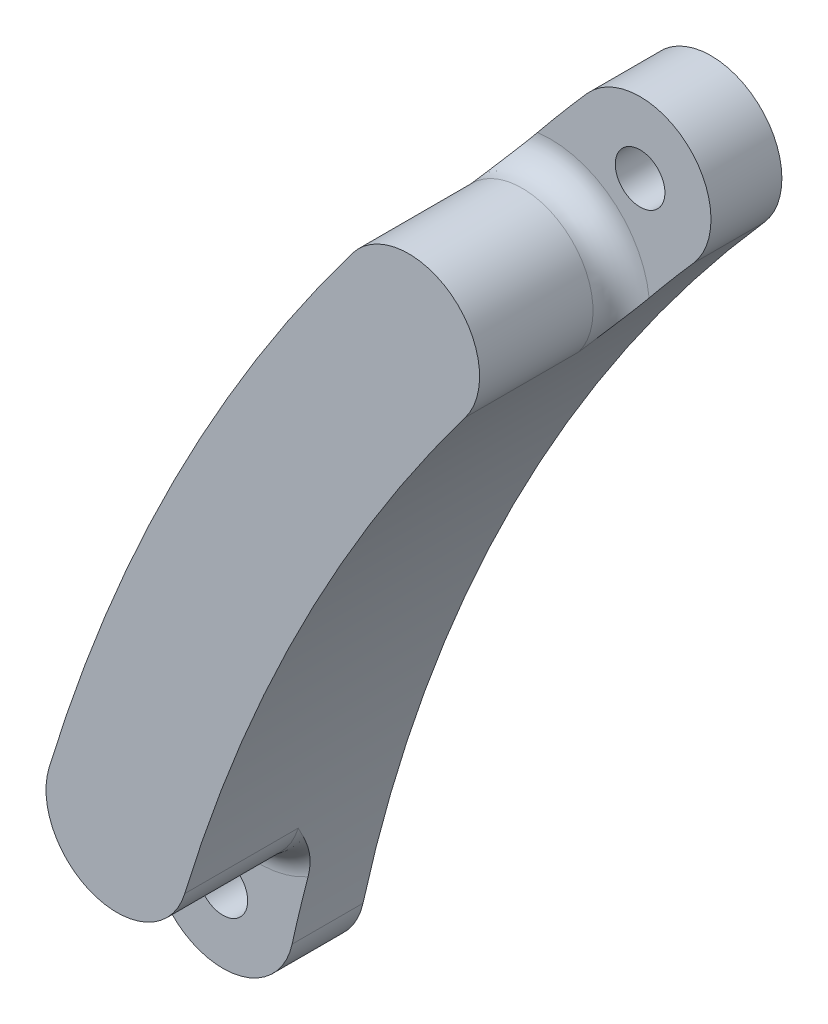
ISO-10303-21;
HEADER;
FILE_DESCRIPTION(('STEP AP214'),'2;1');
FILE_NAME('part.step','',(''),(''),'','','');
FILE_SCHEMA(('AUTOMOTIVE_DESIGN { 1 0 10303 214 1 1 1 1 }'));
ENDSEC;
DATA;
#1=APPLICATION_CONTEXT('core data for automotive mechanical design processes');
#2=APPLICATION_PROTOCOL_DEFINITION('international standard','automotive_design',2000,#1);
#3=PRODUCT_CONTEXT('',#1,'mechanical');
#4=PRODUCT('Part','Part','',(#3));
#5=PRODUCT_RELATED_PRODUCT_CATEGORY('part','',(#4));
#6=PRODUCT_DEFINITION_FORMATION('','',#4);
#7=PRODUCT_DEFINITION_CONTEXT('part definition',#1,'design');
#8=PRODUCT_DEFINITION('design','',#6,#7);
#9=PRODUCT_DEFINITION_SHAPE('','',#8);
#10=(LENGTH_UNIT() NAMED_UNIT(*) SI_UNIT(.MILLI.,.METRE.));
#11=(NAMED_UNIT(*) PLANE_ANGLE_UNIT() SI_UNIT($,.RADIAN.));
#12=(NAMED_UNIT(*) SI_UNIT($,.STERADIAN.) SOLID_ANGLE_UNIT());
#13=UNCERTAINTY_MEASURE_WITH_UNIT(LENGTH_MEASURE(1.E-05),#10,'distance_accuracy_value','');
#14=(GEOMETRIC_REPRESENTATION_CONTEXT(3) GLOBAL_UNCERTAINTY_ASSIGNED_CONTEXT((#13)) GLOBAL_UNIT_ASSIGNED_CONTEXT((#10,
#11,#12)) REPRESENTATION_CONTEXT('',''));
#15=CARTESIAN_POINT('',(0.,0.,0.));
#16=DIRECTION('',(0.,0.,1.));
#17=DIRECTION('',(1.,0.,0.));
#18=AXIS2_PLACEMENT_3D('',#15,#16,#17);
#19=CARTESIAN_POINT('',(78.1862958214698,14.9800916458352,5.));
#20=DIRECTION('',(0.,0.,1.));
#21=DIRECTION('',(1.,0.,0.));
#22=AXIS2_PLACEMENT_3D('',#19,#20,#21);
#23=PLANE('',#22);
#24=CARTESIAN_POINT('',(126.949051310368,-27.9988994676136,5.));
#25=DIRECTION('',(0.,0.,1.));
#26=DIRECTION('',(1.,0.,0.));
#27=AXIS2_PLACEMENT_3D('',#24,#25,#26);
#28=CIRCLE('',#27,135.);
#29=CARTESIAN_POINT('',(25.6725591411177,61.2651589987802,5.));
#30=VERTEX_POINT('',#29);
#31=CARTESIAN_POINT('',(22.1873706540222,57.1479752023225,5.));
#32=VERTEX_POINT('',#31);
#33=EDGE_CURVE('E178',#30,#32,#28,.T.);
#34=ORIENTED_EDGE('',*,*,#33,.T.);
#35=CARTESIAN_POINT('',(23.1048173236408,50.2083576618232,5.));
#36=DIRECTION('',(0.,0.,1.));
#37=DIRECTION('',(1.,0.,0.));
#38=AXIS2_PLACEMENT_3D('',#35,#36,#37);
#39=CIRCLE('',#38,7.);
#40=CARTESIAN_POINT('',(30.061993761383,50.9814656841103,5.));
#41=VERTEX_POINT('',#40);
#42=EDGE_CURVE('E218',#32,#41,#39,.F.);
#43=ORIENTED_EDGE('',*,*,#42,.T.);
#44=CARTESIAN_POINT('',(126.949051310368,-27.9988994676136,5.));
#45=DIRECTION('',(0.,0.,-1.));
#46=DIRECTION('',(1.,0.,0.));
#47=AXIS2_PLACEMENT_3D('',#44,#45,#46);
#48=CIRCLE('',#47,125.);
#49=CARTESIAN_POINT('',(33.1745215240252,54.653006519788,5.));
#50=VERTEX_POINT('',#49);
#51=EDGE_CURVE('E185',#41,#50,#48,.T.);
#52=ORIENTED_EDGE('',*,*,#51,.T.);
#53=CARTESIAN_POINT('',(29.4235403325714,57.9590827592841,5.));
#54=DIRECTION('',(0.,0.,1.));
#55=DIRECTION('',(1.,0.,0.));
#56=AXIS2_PLACEMENT_3D('',#53,#54,#55);
#57=CIRCLE('',#56,5.);
#58=EDGE_CURVE('E172',#50,#30,#57,.T.);
#59=ORIENTED_EDGE('',*,*,#58,.T.);
#60=EDGE_LOOP('',(#34,#43,#52,#59));
#61=FACE_BOUND('',#60,.T.);
#62=CARTESIAN_POINT('',(29.4235403325714,57.9590827592841,5.));
#63=DIRECTION('',(0.,0.,1.));
#64=DIRECTION('',(1.,0.,0.));
#65=AXIS2_PLACEMENT_3D('',#62,#63,#64);
#66=CIRCLE('',#65,1.75);
#67=CARTESIAN_POINT('',(31.1735403325714,57.9590827592841,5.));
#68=VERTEX_POINT('',#67);
#69=EDGE_CURVE('E154',#68,#68,#66,.T.);
#70=ORIENTED_EDGE('',*,*,#69,.F.);
#71=EDGE_LOOP('',(#70));
#72=FACE_BOUND('',#71,.T.);
#73=ADVANCED_FACE('F39',(#61,#72),#23,.T.);
#74=CARTESIAN_POINT('',(4.88265581962952,-1.07688074875437,5.));
#75=VERTEX_POINT('',#74);
#76=CARTESIAN_POINT('',(6.00963506176895,3.60264475807368,5.));
#77=VERTEX_POINT('',#76);
#78=EDGE_CURVE('E186',#75,#77,#48,.T.);
#79=ORIENTED_EDGE('',*,*,#78,.T.);
#80=CARTESIAN_POINT('',(2.52775679828154,9.67524912179224,5.));
#81=DIRECTION('',(0.,0.,1.));
#82=DIRECTION('',(1.,0.,0.));
#83=AXIS2_PLACEMENT_3D('',#80,#81,#82);
#84=CIRCLE('',#83,6.99999999999999);
#85=CARTESIAN_POINT('',(-3.61585854962601,6.32025426979101,5.));
#86=VERTEX_POINT('',#85);
#87=EDGE_CURVE('E66',#77,#86,#84,.F.);
#88=ORIENTED_EDGE('',*,*,#87,.T.);
#89=CARTESIAN_POINT('',(-4.88265581962952,1.07688074875439,5.));
#90=VERTEX_POINT('',#89);
#91=EDGE_CURVE('E176',#86,#90,#28,.T.);
#92=ORIENTED_EDGE('',*,*,#91,.T.);
#93=CARTESIAN_POINT('',(0.,0.,5.));
#94=DIRECTION('',(0.,0.,1.));
#95=DIRECTION('',(1.,0.,0.));
#96=AXIS2_PLACEMENT_3D('',#93,#94,#95);
#97=CIRCLE('',#96,4.99999999999998);
#98=EDGE_CURVE('E182',#90,#75,#97,.T.);
#99=ORIENTED_EDGE('',*,*,#98,.T.);
#100=EDGE_LOOP('',(#79,#88,#92,#99));
#101=FACE_BOUND('',#100,.T.);
#102=CARTESIAN_POINT('',(0.,0.,5.));
#103=DIRECTION('',(0.,0.,1.));
#104=DIRECTION('',(1.,0.,0.));
#105=AXIS2_PLACEMENT_3D('',#102,#103,#104);
#106=CIRCLE('',#105,1.75);
#107=CARTESIAN_POINT('',(1.75,0.,5.));
#108=VERTEX_POINT('',#107);
#109=EDGE_CURVE('E164',#108,#108,#106,.T.);
#110=ORIENTED_EDGE('',*,*,#109,.F.);
#111=EDGE_LOOP('',(#110));
#112=FACE_BOUND('',#111,.T.);
#113=ADVANCED_FACE('F253',(#101,#112),#23,.T.);
#114=CARTESIAN_POINT('',(78.1862958214698,14.9800916458352,0.));
#115=DIRECTION('',(0.,0.,1.));
#116=DIRECTION('',(1.,0.,0.));
#117=AXIS2_PLACEMENT_3D('',#114,#115,#116);
#118=PLANE('',#117);
#119=CARTESIAN_POINT('',(29.4235403325714,57.9590827592841,0.));
#120=DIRECTION('',(0.,0.,1.));
#121=DIRECTION('',(1.,0.,0.));
#122=AXIS2_PLACEMENT_3D('',#119,#120,#121);
#123=CIRCLE('',#122,5.);
#124=CARTESIAN_POINT('',(33.1745215240252,54.653006519788,0.));
#125=VERTEX_POINT('',#124);
#126=CARTESIAN_POINT('',(25.6725591411177,61.2651589987802,0.));
#127=VERTEX_POINT('',#126);
#128=EDGE_CURVE('E168',#125,#127,#123,.T.);
#129=ORIENTED_EDGE('',*,*,#128,.F.);
#130=CARTESIAN_POINT('',(126.949051310368,-27.9988994676136,0.));
#131=DIRECTION('',(0.,0.,-1.));
#132=DIRECTION('',(1.,0.,0.));
#133=AXIS2_PLACEMENT_3D('',#130,#131,#132);
#134=CIRCLE('',#133,125.);
#135=CARTESIAN_POINT('',(4.88265581962952,-1.07688074875437,0.));
#136=VERTEX_POINT('',#135);
#137=EDGE_CURVE('E177',#136,#125,#134,.T.);
#138=ORIENTED_EDGE('',*,*,#137,.F.);
#139=CARTESIAN_POINT('',(0.,0.,0.));
#140=DIRECTION('',(0.,0.,1.));
#141=DIRECTION('',(1.,0.,0.));
#142=AXIS2_PLACEMENT_3D('',#139,#140,#141);
#143=CIRCLE('',#142,4.99999999999998);
#144=CARTESIAN_POINT('',(-4.88265581962952,1.07688074875439,0.));
#145=VERTEX_POINT('',#144);
#146=EDGE_CURVE('E196',#145,#136,#143,.T.);
#147=ORIENTED_EDGE('',*,*,#146,.F.);
#148=CARTESIAN_POINT('',(126.949051310368,-27.9988994676136,0.));
#149=DIRECTION('',(0.,0.,1.));
#150=DIRECTION('',(1.,0.,0.));
#151=AXIS2_PLACEMENT_3D('',#148,#149,#150);
#152=CIRCLE('',#151,135.);
#153=EDGE_CURVE('E193',#127,#145,#152,.T.);
#154=ORIENTED_EDGE('',*,*,#153,.F.);
#155=EDGE_LOOP('',(#129,#138,#147,#154));
#156=FACE_BOUND('',#155,.T.);
#157=CARTESIAN_POINT('',(0.,0.,0.));
#158=DIRECTION('',(0.,0.,1.));
#159=DIRECTION('',(1.,0.,0.));
#160=AXIS2_PLACEMENT_3D('',#157,#158,#159);
#161=CIRCLE('',#160,1.75);
#162=CARTESIAN_POINT('',(1.75,0.,0.));
#163=VERTEX_POINT('',#162);
#164=EDGE_CURVE('E162',#163,#163,#161,.T.);
#165=ORIENTED_EDGE('',*,*,#164,.T.);
#166=EDGE_LOOP('',(#165));
#167=FACE_BOUND('',#166,.T.);
#168=CARTESIAN_POINT('',(29.4235403325714,57.9590827592841,0.));
#169=DIRECTION('',(0.,0.,1.));
#170=DIRECTION('',(1.,0.,0.));
#171=AXIS2_PLACEMENT_3D('',#168,#169,#170);
#172=CIRCLE('',#171,1.75);
#173=CARTESIAN_POINT('',(31.1735403325714,57.9590827592841,0.));
#174=VERTEX_POINT('',#173);
#175=EDGE_CURVE('E148',#174,#174,#172,.T.);
#176=ORIENTED_EDGE('',*,*,#175,.T.);
#177=EDGE_LOOP('',(#176));
#178=FACE_BOUND('',#177,.T.);
#179=ADVANCED_FACE('F248',(#156,#167,#178),#118,.F.);
#180=CARTESIAN_POINT('',(29.4235403325714,57.9590827592841,5.));
#181=DIRECTION('',(0.,0.,-1.));
#182=DIRECTION('',(-1.,0.,0.));
#183=AXIS2_PLACEMENT_3D('',#180,#181,#182);
#184=CYLINDRICAL_SURFACE('',#183,5.);
#185=ORIENTED_EDGE('',*,*,#128,.T.);
#186=DIRECTION('',(0.,0.,-1.));
#187=VECTOR('',#186,1.);
#188=CARTESIAN_POINT('',(25.6725591411177,61.2651589987802,5.));
#189=LINE('',#188,#187);
#190=EDGE_CURVE('E212',#30,#127,#189,.T.);
#191=ORIENTED_EDGE('',*,*,#190,.F.);
#192=ORIENTED_EDGE('',*,*,#58,.F.);
#193=DIRECTION('',(0.,0.,-1.));
#194=VECTOR('',#193,1.);
#195=CARTESIAN_POINT('',(33.1745215240252,54.653006519788,5.));
#196=LINE('',#195,#194);
#197=EDGE_CURVE('E189',#50,#125,#196,.T.);
#198=ORIENTED_EDGE('',*,*,#197,.T.);
#199=EDGE_LOOP('',(#185,#191,#192,#198));
#200=FACE_BOUND('',#199,.T.);
#201=ADVANCED_FACE('F245',(#200),#184,.T.);
#202=CARTESIAN_POINT('',(126.949051310368,-27.9988994676136,5.));
#203=DIRECTION('',(0.,0.,-1.));
#204=DIRECTION('',(-1.,0.,0.));
#205=AXIS2_PLACEMENT_3D('',#202,#203,#204);
#206=CYLINDRICAL_SURFACE('',#205,135.);
#207=ORIENTED_EDGE('',*,*,#153,.T.);
#208=DIRECTION('',(0.,0.,-1.));
#209=VECTOR('',#208,1.);
#210=CARTESIAN_POINT('',(-4.88265581962952,1.07688074875439,5.));
#211=LINE('',#210,#209);
#212=EDGE_CURVE('E208',#90,#145,#211,.T.);
#213=ORIENTED_EDGE('',*,*,#212,.F.);
#214=ORIENTED_EDGE('',*,*,#91,.F.);
#215=CARTESIAN_POINT('',(-3.61585854962601,6.32025426979102,5.));
#216=CARTESIAN_POINT('',(-3.58034784400264,6.45535793828626,5.00002594117785));
#217=CARTESIAN_POINT('',(-3.54467000438248,6.59023317841349,5.00689417379363));
#218=CARTESIAN_POINT('',(-3.47325636629408,6.85853594984312,5.03268541984538));
#219=CARTESIAN_POINT('',(-3.43752083526487,6.99196587637259,5.05158376986629));
#220=CARTESIAN_POINT('',(-3.33156201155892,7.38520243853761,5.12316571385264));
#221=CARTESIAN_POINT('',(-3.26144151456272,7.64230746459036,5.19084506304292));
#222=CARTESIAN_POINT('',(-3.11248783491293,8.18238902567926,5.36786030247846));
#223=CARTESIAN_POINT('',(-3.03383257264864,8.46384994826898,5.48174916034585));
#224=CARTESIAN_POINT('',(-2.87796370168592,9.01498982158747,5.73627694294858));
#225=CARTESIAN_POINT('',(-2.80075242282836,9.28465053843852,5.87695558515314));
#226=CARTESIAN_POINT('',(-2.56940067565736,10.0836765162828,6.32588745877069));
#227=CARTESIAN_POINT('',(-2.41671576131768,10.5988534191459,6.65930757134919));
#228=CARTESIAN_POINT('',(-2.26004314599998,11.1164418337076,6.99493362914347));
#229=CARTESIAN_POINT('',(-2.25886045817974,11.1203483746645,6.99746683145223));
#230=CARTESIAN_POINT('',(-2.25767760602947,11.1242548367694,7.));
#231=B_SPLINE_CURVE_WITH_KNOTS('',3,(#215,#216,#217,#218,#219,#220,#221,#222,#223,#224,#225,
#226,#227,#228,#229,#230),.UNSPECIFIED.,.F.,.F.,(4,2,2,2,2,2,2,4),(0.,0.418639229746047,
0.836422942873475,1.65864415195929,2.59770968019831,3.53817842384696,5.43314859807136,
5.44756013192502),.UNSPECIFIED.);
#232=CARTESIAN_POINT('',(-2.25767760602946,11.1242548367694,7.));
#233=VERTEX_POINT('',#232);
#234=EDGE_CURVE('E11',#86,#233,#231,.T.);
#235=ORIENTED_EDGE('',*,*,#234,.T.);
#236=DIRECTION('',(0.,0.,-1.));
#237=VECTOR('',#236,1.);
#238=CARTESIAN_POINT('',(-2.25767760602946,11.1242548367694,15.));
#239=LINE('',#238,#237);
#240=CARTESIAN_POINT('',(-2.25767760602946,11.1242548367694,15.));
#241=VERTEX_POINT('',#240);
#242=EDGE_CURVE('E127',#241,#233,#239,.T.);
#243=ORIENTED_EDGE('',*,*,#242,.F.);
#244=CARTESIAN_POINT('',(126.949051310368,-27.9988994676134,15.));
#245=DIRECTION('',(0.,0.,1.));
#246=DIRECTION('',(1.,0.,0.));
#247=AXIS2_PLACEMENT_3D('',#244,#245,#246);
#248=CIRCLE('',#247,134.999999999999);
#249=CARTESIAN_POINT('',(19.1108083241513,53.2163290898784,15.));
#250=VERTEX_POINT('',#249);
#251=EDGE_CURVE('E121',#250,#241,#248,.T.);
#252=ORIENTED_EDGE('',*,*,#251,.F.);
#253=DIRECTION('',(0.,0.,-1.));
#254=VECTOR('',#253,1.);
#255=CARTESIAN_POINT('',(19.1108083241513,53.2163290898784,15.));
#256=LINE('',#255,#254);
#257=CARTESIAN_POINT('',(19.1108083241513,53.2163290898784,7.));
#258=VERTEX_POINT('',#257);
#259=EDGE_CURVE('E125',#250,#258,#256,.T.);
#260=ORIENTED_EDGE('',*,*,#259,.T.);
#261=CARTESIAN_POINT('',(22.1873706540222,57.1479752023225,5.));
#262=CARTESIAN_POINT('',(22.0992629981813,57.0395729309582,5.00002594117785));
#263=CARTESIAN_POINT('',(22.0114383852353,56.9311705509096,5.00689417379361));
#264=CARTESIAN_POINT('',(21.8369920598221,56.7151734110871,5.03268541984532));
#265=CARTESIAN_POINT('',(21.7503682559187,56.6075774535939,5.0515837698662));
#266=CARTESIAN_POINT('',(21.4954542982894,56.2899595379304,5.12316571385253));
#267=CARTESIAN_POINT('',(21.3292844094954,56.0816149997757,5.19084506304288));
#268=CARTESIAN_POINT('',(20.981201348489,55.6426235716701,5.36786030247844));
#269=CARTESIAN_POINT('',(20.8004066822143,55.4130147959806,5.48174916034576));
#270=CARTESIAN_POINT('',(20.4474777666826,54.961914534976,5.73627694294893));
#271=CARTESIAN_POINT('',(20.2753568620929,54.7404356917457,5.87695558515399));
#272=CARTESIAN_POINT('',(19.7668650009958,54.082102818961,6.32588745876994));
#273=CARTESIAN_POINT('',(19.4410888652309,53.6547975022611,6.65930757134331));
#274=CARTESIAN_POINT('',(19.1157194457968,53.2228498015244,6.99493362914365));
#275=CARTESIAN_POINT('',(19.1132638046544,53.2195894887625,6.99746683145232));
#276=CARTESIAN_POINT('',(19.1108083241513,53.2163290898784,7.));
#277=B_SPLINE_CURVE_WITH_KNOTS('',3,(#261,#262,#263,#264,#265,#266,#267,#268,#269,#270,#271,
#272,#273,#274,#275,#276),.UNSPECIFIED.,.F.,.F.,(4,2,2,2,2,2,2,4),(0.,0.418639229745681,
0.836422942872823,1.6586441519593,2.59770968019864,3.53817842384782,5.43314859807214,
5.44756013192503),.UNSPECIFIED.);
#278=EDGE_CURVE('E227',#258,#32,#277,.F.);
#279=ORIENTED_EDGE('',*,*,#278,.T.);
#280=ORIENTED_EDGE('',*,*,#33,.F.);
#281=ORIENTED_EDGE('',*,*,#190,.T.);
#282=EDGE_LOOP('',(#207,#213,#214,#235,#243,#252,#260,#279,#280,#281));
#283=FACE_BOUND('',#282,.T.);
#284=ADVANCED_FACE('F123',(#283),#206,.T.);
#285=CARTESIAN_POINT('',(0.,0.,5.));
#286=DIRECTION('',(0.,0.,-1.));
#287=DIRECTION('',(-1.,0.,0.));
#288=AXIS2_PLACEMENT_3D('',#285,#286,#287);
#289=CYLINDRICAL_SURFACE('',#288,4.99999999999998);
#290=ORIENTED_EDGE('',*,*,#146,.T.);
#291=DIRECTION('',(0.,0.,-1.));
#292=VECTOR('',#291,1.);
#293=CARTESIAN_POINT('',(4.88265581962952,-1.07688074875437,5.));
#294=LINE('',#293,#292);
#295=EDGE_CURVE('E204',#75,#136,#294,.T.);
#296=ORIENTED_EDGE('',*,*,#295,.F.);
#297=ORIENTED_EDGE('',*,*,#98,.F.);
#298=ORIENTED_EDGE('',*,*,#212,.T.);
#299=EDGE_LOOP('',(#290,#296,#297,#298));
#300=FACE_BOUND('',#299,.T.);
#301=ADVANCED_FACE('F244',(#300),#289,.T.);
#302=CARTESIAN_POINT('',(126.949051310368,-27.9988994676136,5.));
#303=DIRECTION('',(0.,0.,-1.));
#304=DIRECTION('',(-1.,0.,0.));
#305=AXIS2_PLACEMENT_3D('',#302,#303,#304);
#306=CYLINDRICAL_SURFACE('',#305,125.);
#307=ORIENTED_EDGE('',*,*,#137,.T.);
#308=ORIENTED_EDGE('',*,*,#197,.F.);
#309=ORIENTED_EDGE('',*,*,#51,.F.);
#310=CARTESIAN_POINT('',(30.061993761383,50.9814656841103,5.));
#311=CARTESIAN_POINT('',(29.9795827243019,50.8803723637186,5.00002043487872));
#312=CARTESIAN_POINT('',(29.8974380149031,50.7792781676456,5.0064911216546));
#313=CARTESIAN_POINT('',(29.7342915612442,50.5778602347245,5.03081092269958));
#314=CARTESIAN_POINT('',(29.6532878002069,50.4775353349684,5.04863641580719));
#315=CARTESIAN_POINT('',(29.4150613299969,50.1815597786684,5.11615858522455));
#316=CARTESIAN_POINT('',(29.2598574701728,49.9875134160137,5.1800070212195));
#317=CARTESIAN_POINT('',(28.9256077723367,49.5671422063599,5.35185144043907));
#318=CARTESIAN_POINT('',(28.7481328083294,49.3422790929907,5.46618520461401));
#319=CARTESIAN_POINT('',(28.4023490493346,48.9012060842068,5.72246456451719));
#320=CARTESIAN_POINT('',(28.2340572127283,48.6850123814477,5.86445916993723));
#321=CARTESIAN_POINT('',(27.9033271587865,48.2573675889763,6.16662348475507));
#322=CARTESIAN_POINT('',(27.740952457775,48.0459739802235,6.32694030488667));
#323=CARTESIAN_POINT('',(27.4207745816371,47.6264384670329,6.6556519591586));
#324=CARTESIAN_POINT('',(27.2629688446223,47.4182947717148,6.82404212002972));
#325=CARTESIAN_POINT('',(27.1035003653779,47.206592162194,6.99498902829866));
#326=CARTESIAN_POINT('',(27.1011632722094,47.2034892517616,6.99749451510882));
#327=CARTESIAN_POINT('',(27.0988263231303,47.2003862337679,7.));
#328=B_SPLINE_CURVE_WITH_KNOTS('',3,(#310,#311,#312,#313,#314,#315,#316,#317,#318,#319,#320,
#321,#322,#323,#324,#325,#326,#327),.UNSPECIFIED.,.F.,.F.,(4,2,2,2,2,2,2,2,4),(0.,
0.390869660804278,0.780928847472415,1.54806296438097,2.47121862225078,3.39602506079085,
4.32886170647124,5.26116474789812,5.27503225281395),.UNSPECIFIED.);
#329=CARTESIAN_POINT('',(27.0988263231303,47.2003862337679,7.));
#330=VERTEX_POINT('',#329);
#331=EDGE_CURVE('E233',#41,#330,#328,.T.);
#332=ORIENTED_EDGE('',*,*,#331,.T.);
#333=DIRECTION('',(0.,0.,-1.));
#334=VECTOR('',#333,1.);
#335=CARTESIAN_POINT('',(27.0988263231303,47.2003862337679,15.));
#336=LINE('',#335,#334);
#337=CARTESIAN_POINT('',(27.0988263231303,47.2003862337679,15.));
#338=VERTEX_POINT('',#337);
#339=EDGE_CURVE('E281',#338,#330,#336,.T.);
#340=ORIENTED_EDGE('',*,*,#339,.F.);
#341=CARTESIAN_POINT('',(126.949051310368,-27.9988994676134,15.));
#342=DIRECTION('',(0.,0.,-1.));
#343=DIRECTION('',(1.,0.,0.));
#344=AXIS2_PLACEMENT_3D('',#341,#342,#343);
#345=CIRCLE('',#344,124.999999999999);
#346=CARTESIAN_POINT('',(7.31319120259255,8.2262434068151,15.));
#347=VERTEX_POINT('',#346);
#348=EDGE_CURVE('E137',#347,#338,#345,.T.);
#349=ORIENTED_EDGE('',*,*,#348,.F.);
#350=DIRECTION('',(0.,0.,-1.));
#351=VECTOR('',#350,1.);
#352=CARTESIAN_POINT('',(7.31319120259255,8.2262434068151,15.));
#353=LINE('',#352,#351);
#354=CARTESIAN_POINT('',(7.31319120259255,8.2262434068151,7.));
#355=VERTEX_POINT('',#354);
#356=EDGE_CURVE('E156',#347,#355,#353,.T.);
#357=ORIENTED_EDGE('',*,*,#356,.T.);
#358=CARTESIAN_POINT('',(6.00963506176894,3.60264475807368,5.));
#359=CARTESIAN_POINT('',(6.04260748883686,3.72883611083867,5.00002043487866));
#360=CARTESIAN_POINT('',(6.07573780409202,3.85481298161952,5.00649112165411));
#361=CARTESIAN_POINT('',(6.14205101987392,4.10538933016853,5.03081092269757));
#362=CARTESIAN_POINT('',(6.17523366892167,4.22999112234875,5.04863641580418));
#363=CARTESIAN_POINT('',(6.27356985049491,4.59698346073365,5.11615858522035));
#364=CARTESIAN_POINT('',(6.33861976654031,4.83679742486103,5.18000702121653));
#365=CARTESIAN_POINT('',(6.48070604572626,5.35472242298893,5.35185144044013));
#366=CARTESIAN_POINT('',(6.55748949115213,5.63070264893311,5.46618520461756));
#367=CARTESIAN_POINT('',(6.70948057400879,6.17015655595775,5.72246456451906));
#368=CARTESIAN_POINT('',(6.78468514806498,6.43360699043559,5.86445916993521));
#369=CARTESIAN_POINT('',(6.93472040808993,6.952983402922,6.16662348477262));
#370=CARTESIAN_POINT('',(7.00954217737306,7.20882418188819,6.32694030492755));
#371=CARTESIAN_POINT('',(7.15925873037746,7.71489618565097,6.65565195913025));
#372=CARTESIAN_POINT('',(7.23415344785029,7.9651305355292,6.82404211990883));
#373=CARTESIAN_POINT('',(7.31093985867793,8.21880757000352,6.99498902829561));
#374=CARTESIAN_POINT('',(7.31206544470034,8.22252551482873,6.99749451510727));
#375=CARTESIAN_POINT('',(7.31319120259257,8.22624340681509,7.));
#376=B_SPLINE_CURVE_WITH_KNOTS('',3,(#358,#359,#360,#361,#362,#363,#364,#365,#366,#367,#368,
#369,#370,#371,#372,#373,#374,#375),.UNSPECIFIED.,.F.,.F.,(4,2,2,2,2,2,2,2,4),(0.,
0.390869660790445,0.780928847447801,1.54806296438096,2.47121862225569,3.39602506081021,
4.32886170648392,5.26116474789976,5.2750322528139),.UNSPECIFIED.);
#377=EDGE_CURVE('E53',#355,#77,#376,.F.);
#378=ORIENTED_EDGE('',*,*,#377,.T.);
#379=ORIENTED_EDGE('',*,*,#78,.F.);
#380=ORIENTED_EDGE('',*,*,#295,.T.);
#381=EDGE_LOOP('',(#307,#308,#309,#332,#340,#349,#357,#378,#379,#380));
#382=FACE_BOUND('',#381,.T.);
#383=ADVANCED_FACE('F266',(#382),#306,.F.);
#384=CARTESIAN_POINT('',(0.,0.,5.));
#385=DIRECTION('',(0.,0.,-1.));
#386=DIRECTION('',(-1.,0.,0.));
#387=AXIS2_PLACEMENT_3D('',#384,#385,#386);
#388=CYLINDRICAL_SURFACE('',#387,1.75);
#389=ORIENTED_EDGE('',*,*,#109,.T.);
#390=EDGE_LOOP('',(#389));
#391=FACE_BOUND('',#390,.T.);
#392=ORIENTED_EDGE('',*,*,#164,.F.);
#393=EDGE_LOOP('',(#392));
#394=FACE_BOUND('',#393,.T.);
#395=ADVANCED_FACE('F264',(#391,#394),#388,.F.);
#396=CARTESIAN_POINT('',(29.4235403325714,57.9590827592841,5.));
#397=DIRECTION('',(0.,0.,-1.));
#398=DIRECTION('',(-1.,0.,0.));
#399=AXIS2_PLACEMENT_3D('',#396,#397,#398);
#400=CYLINDRICAL_SURFACE('',#399,1.75);
#401=ORIENTED_EDGE('',*,*,#69,.T.);
#402=EDGE_LOOP('',(#401));
#403=FACE_BOUND('',#402,.T.);
#404=ORIENTED_EDGE('',*,*,#175,.F.);
#405=EDGE_LOOP('',(#404));
#406=FACE_BOUND('',#405,.T.);
#407=ADVANCED_FACE('F411',(#403,#406),#400,.F.);
#408=CARTESIAN_POINT('',(23.1048173236408,50.2083576618232,15.));
#409=DIRECTION('',(0.,0.,-1.));
#410=DIRECTION('',(-1.,0.,0.));
#411=AXIS2_PLACEMENT_3D('',#408,#409,#410);
#412=CYLINDRICAL_SURFACE('',#411,5.);
#413=ORIENTED_EDGE('',*,*,#339,.T.);
#414=CARTESIAN_POINT('',(23.1048173236408,50.2083576618232,7.));
#415=DIRECTION('',(0.,0.,1.));
#416=DIRECTION('',(1.,0.,0.));
#417=AXIS2_PLACEMENT_3D('',#414,#415,#416);
#418=CIRCLE('',#417,5.);
#419=EDGE_CURVE('E146',#330,#258,#418,.T.);
#420=ORIENTED_EDGE('',*,*,#419,.T.);
#421=ORIENTED_EDGE('',*,*,#259,.F.);
#422=CARTESIAN_POINT('',(23.1048173236408,50.2083576618232,15.));
#423=DIRECTION('',(0.,0.,1.));
#424=DIRECTION('',(1.,0.,0.));
#425=AXIS2_PLACEMENT_3D('',#422,#423,#424);
#426=CIRCLE('',#425,5.);
#427=EDGE_CURVE('E132',#338,#250,#426,.T.);
#428=ORIENTED_EDGE('',*,*,#427,.F.);
#429=EDGE_LOOP('',(#413,#420,#421,#428));
#430=FACE_BOUND('',#429,.T.);
#431=ADVANCED_FACE('F144',(#430),#412,.T.);
#432=CARTESIAN_POINT('',(2.52775679828154,9.67524912179224,15.));
#433=DIRECTION('',(0.,0.,-1.));
#434=DIRECTION('',(-1.,0.,0.));
#435=AXIS2_PLACEMENT_3D('',#432,#433,#434);
#436=CYLINDRICAL_SURFACE('',#435,4.99999999999999);
#437=ORIENTED_EDGE('',*,*,#242,.T.);
#438=CARTESIAN_POINT('',(2.52775679828154,9.67524912179224,7.));
#439=DIRECTION('',(0.,0.,1.));
#440=DIRECTION('',(1.,0.,0.));
#441=AXIS2_PLACEMENT_3D('',#438,#439,#440);
#442=CIRCLE('',#441,4.99999999999999);
#443=EDGE_CURVE('E221',#233,#355,#442,.T.);
#444=ORIENTED_EDGE('',*,*,#443,.T.);
#445=ORIENTED_EDGE('',*,*,#356,.F.);
#446=CARTESIAN_POINT('',(2.52775679828154,9.67524912179224,15.));
#447=DIRECTION('',(0.,0.,1.));
#448=DIRECTION('',(1.,0.,0.));
#449=AXIS2_PLACEMENT_3D('',#446,#447,#448);
#450=CIRCLE('',#449,4.99999999999999);
#451=EDGE_CURVE('E131',#241,#347,#450,.T.);
#452=ORIENTED_EDGE('',*,*,#451,.F.);
#453=EDGE_LOOP('',(#437,#444,#445,#452));
#454=FACE_BOUND('',#453,.T.);
#455=ADVANCED_FACE('F302',(#454),#436,.T.);
#456=CARTESIAN_POINT('',(75.0269343170042,11.1047290971049,15.));
#457=DIRECTION('',(0.,0.,1.));
#458=DIRECTION('',(1.,0.,0.));
#459=AXIS2_PLACEMENT_3D('',#456,#457,#458);
#460=PLANE('',#459);
#461=ORIENTED_EDGE('',*,*,#427,.T.);
#462=ORIENTED_EDGE('',*,*,#251,.T.);
#463=ORIENTED_EDGE('',*,*,#451,.T.);
#464=ORIENTED_EDGE('',*,*,#348,.T.);
#465=EDGE_LOOP('',(#461,#462,#463,#464));
#466=FACE_BOUND('',#465,.T.);
#467=ADVANCED_FACE('F135',(#466),#460,.T.);
#468=CARTESIAN_POINT('',(23.1048173236408,50.2083576618232,7.));
#469=DIRECTION('',(0.,0.,1.));
#470=DIRECTION('',(1.,0.,0.));
#471=AXIS2_PLACEMENT_3D('',#468,#469,#470);
#472=TOROIDAL_SURFACE('',#471,7.,2.);
#473=ORIENTED_EDGE('',*,*,#331,.F.);
#474=ORIENTED_EDGE('',*,*,#42,.F.);
#475=ORIENTED_EDGE('',*,*,#278,.F.);
#476=ORIENTED_EDGE('',*,*,#419,.F.);
#477=EDGE_LOOP('',(#473,#474,#475,#476));
#478=FACE_BOUND('',#477,.T.);
#479=ADVANCED_FACE('F238',(#478),#472,.F.);
#480=CARTESIAN_POINT('',(2.52775679828154,9.67524912179224,7.));
#481=DIRECTION('',(0.,0.,1.));
#482=DIRECTION('',(1.,0.,0.));
#483=AXIS2_PLACEMENT_3D('',#480,#481,#482);
#484=TOROIDAL_SURFACE('',#483,6.99999999999999,2.);
#485=ORIENTED_EDGE('',*,*,#234,.F.);
#486=ORIENTED_EDGE('',*,*,#87,.F.);
#487=ORIENTED_EDGE('',*,*,#377,.F.);
#488=ORIENTED_EDGE('',*,*,#443,.F.);
#489=EDGE_LOOP('',(#485,#486,#487,#488));
#490=FACE_BOUND('',#489,.T.);
#491=ADVANCED_FACE('F41',(#490),#484,.F.);
#492=CLOSED_SHELL('',(#73,#113,#179,#201,#284,#301,#383,#395,#407,#431,#455,#467,#479,#491));
#493=MANIFOLD_SOLID_BREP('B2',#492);
#494=ADVANCED_BREP_SHAPE_REPRESENTATION('',(#18,#493),#14);
#495=SHAPE_DEFINITION_REPRESENTATION(#9,#494);
ENDSEC;
END-ISO-10303-21;
